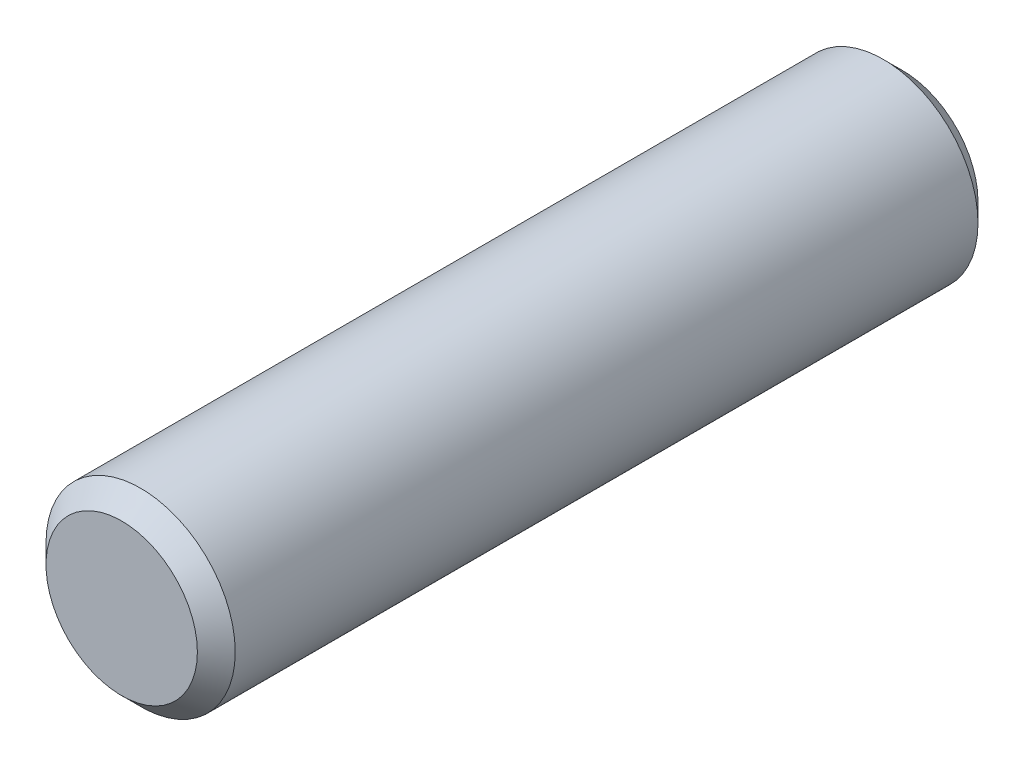
ISO-10303-21;
HEADER;
FILE_DESCRIPTION(('STEP AP214'),'2;1');
FILE_NAME('part.step','',(''),(''),'','','');
FILE_SCHEMA(('AUTOMOTIVE_DESIGN { 1 0 10303 214 1 1 1 1 }'));
ENDSEC;
DATA;
#1=APPLICATION_CONTEXT('core data for automotive mechanical design processes');
#2=APPLICATION_PROTOCOL_DEFINITION('international standard','automotive_design',2000,#1);
#3=PRODUCT_CONTEXT('',#1,'mechanical');
#4=PRODUCT('Part','Part','',(#3));
#5=PRODUCT_RELATED_PRODUCT_CATEGORY('part','',(#4));
#6=PRODUCT_DEFINITION_FORMATION('','',#4);
#7=PRODUCT_DEFINITION_CONTEXT('part definition',#1,'design');
#8=PRODUCT_DEFINITION('design','',#6,#7);
#9=PRODUCT_DEFINITION_SHAPE('','',#8);
#10=(LENGTH_UNIT() NAMED_UNIT(*) SI_UNIT(.MILLI.,.METRE.));
#11=(NAMED_UNIT(*) PLANE_ANGLE_UNIT() SI_UNIT($,.RADIAN.));
#12=(NAMED_UNIT(*) SI_UNIT($,.STERADIAN.) SOLID_ANGLE_UNIT());
#13=UNCERTAINTY_MEASURE_WITH_UNIT(LENGTH_MEASURE(1.E-05),#10,'distance_accuracy_value','');
#14=(GEOMETRIC_REPRESENTATION_CONTEXT(3) GLOBAL_UNCERTAINTY_ASSIGNED_CONTEXT((#13)) GLOBAL_UNIT_ASSIGNED_CONTEXT((#10,
#11,#12)) REPRESENTATION_CONTEXT('',''));
#15=CARTESIAN_POINT('',(0.,0.,0.));
#16=DIRECTION('',(0.,0.,1.));
#17=DIRECTION('',(1.,0.,0.));
#18=AXIS2_PLACEMENT_3D('',#15,#16,#17);
#19=CARTESIAN_POINT('',(0.,0.,16.5));
#20=DIRECTION('',(0.,0.,-1.));
#21=DIRECTION('',(-1.,0.,0.));
#22=AXIS2_PLACEMENT_3D('',#19,#20,#21);
#23=CYLINDRICAL_SURFACE('',#22,4.);
#24=CARTESIAN_POINT('',(0.,0.,-15.7));
#25=DIRECTION('',(0.,0.,1.));
#26=DIRECTION('',(1.,0.,0.));
#27=AXIS2_PLACEMENT_3D('',#24,#25,#26);
#28=CIRCLE('',#27,4.);
#29=CARTESIAN_POINT('',(4.,0.,-15.7));
#30=VERTEX_POINT('',#29);
#31=EDGE_CURVE('E46',#30,#30,#28,.T.);
#32=ORIENTED_EDGE('',*,*,#31,.T.);
#33=EDGE_LOOP('',(#32));
#34=FACE_BOUND('',#33,.T.);
#35=CARTESIAN_POINT('',(0.,0.,15.7));
#36=DIRECTION('',(0.,0.,1.));
#37=DIRECTION('',(1.,0.,0.));
#38=AXIS2_PLACEMENT_3D('',#35,#36,#37);
#39=CIRCLE('',#38,4.);
#40=CARTESIAN_POINT('',(4.,0.,15.7));
#41=VERTEX_POINT('',#40);
#42=EDGE_CURVE('E51',#41,#41,#39,.F.);
#43=ORIENTED_EDGE('',*,*,#42,.T.);
#44=EDGE_LOOP('',(#43));
#45=FACE_BOUND('',#44,.T.);
#46=ADVANCED_FACE('F34',(#34,#45),#23,.T.);
#47=CARTESIAN_POINT('',(0.,0.,16.5));
#48=DIRECTION('',(0.,0.,1.));
#49=DIRECTION('',(1.,0.,0.));
#50=AXIS2_PLACEMENT_3D('',#47,#48,#49);
#51=PLANE('',#50);
#52=CARTESIAN_POINT('',(0.,0.,16.5));
#53=DIRECTION('',(0.,0.,1.));
#54=DIRECTION('',(1.,0.,0.));
#55=AXIS2_PLACEMENT_3D('',#52,#53,#54);
#56=CIRCLE('',#55,3.20000000000001);
#57=CARTESIAN_POINT('',(3.20000000000001,0.,16.5));
#58=VERTEX_POINT('',#57);
#59=EDGE_CURVE('E10',#58,#58,#56,.T.);
#60=ORIENTED_EDGE('',*,*,#59,.T.);
#61=EDGE_LOOP('',(#60));
#62=FACE_BOUND('',#61,.T.);
#63=ADVANCED_FACE('F67',(#62),#51,.T.);
#64=CARTESIAN_POINT('',(0.,0.,-16.5));
#65=DIRECTION('',(0.,0.,1.));
#66=DIRECTION('',(1.,0.,0.));
#67=AXIS2_PLACEMENT_3D('',#64,#65,#66);
#68=PLANE('',#67);
#69=CARTESIAN_POINT('',(0.,0.,-16.5));
#70=DIRECTION('',(0.,0.,1.));
#71=DIRECTION('',(1.,0.,0.));
#72=AXIS2_PLACEMENT_3D('',#69,#70,#71);
#73=CIRCLE('',#72,3.20000000000001);
#74=CARTESIAN_POINT('',(3.20000000000001,0.,-16.5));
#75=VERTEX_POINT('',#74);
#76=EDGE_CURVE('E41',#75,#75,#73,.F.);
#77=ORIENTED_EDGE('',*,*,#76,.T.);
#78=EDGE_LOOP('',(#77));
#79=FACE_BOUND('',#78,.T.);
#80=ADVANCED_FACE('F64',(#79),#68,.F.);
#81=CARTESIAN_POINT('',(0.,0.,-15.7));
#82=DIRECTION('',(0.,0.,1.));
#83=DIRECTION('',(1.,0.,0.));
#84=AXIS2_PLACEMENT_3D('',#81,#82,#83);
#85=CONICAL_SURFACE('',#84,4.,0.785398163397453);
#86=ORIENTED_EDGE('',*,*,#76,.F.);
#87=EDGE_LOOP('',(#86));
#88=FACE_BOUND('',#87,.T.);
#89=ORIENTED_EDGE('',*,*,#31,.F.);
#90=EDGE_LOOP('',(#89));
#91=FACE_BOUND('',#90,.T.);
#92=ADVANCED_FACE('F60',(#88,#91),#85,.T.);
#93=CARTESIAN_POINT('',(0.,0.,16.5));
#94=DIRECTION('',(0.,0.,-1.));
#95=DIRECTION('',(-1.,0.,0.));
#96=AXIS2_PLACEMENT_3D('',#93,#94,#95);
#97=CONICAL_SURFACE('',#96,3.20000000000001,0.785398163397446);
#98=ORIENTED_EDGE('',*,*,#42,.F.);
#99=EDGE_LOOP('',(#98));
#100=FACE_BOUND('',#99,.T.);
#101=ORIENTED_EDGE('',*,*,#59,.F.);
#102=EDGE_LOOP('',(#101));
#103=FACE_BOUND('',#102,.T.);
#104=ADVANCED_FACE('F36',(#100,#103),#97,.T.);
#105=CLOSED_SHELL('',(#46,#63,#80,#92,#104));
#106=MANIFOLD_SOLID_BREP('B2',#105);
#107=ADVANCED_BREP_SHAPE_REPRESENTATION('',(#18,#106),#14);
#108=SHAPE_DEFINITION_REPRESENTATION(#9,#107);
ENDSEC;
END-ISO-10303-21;
